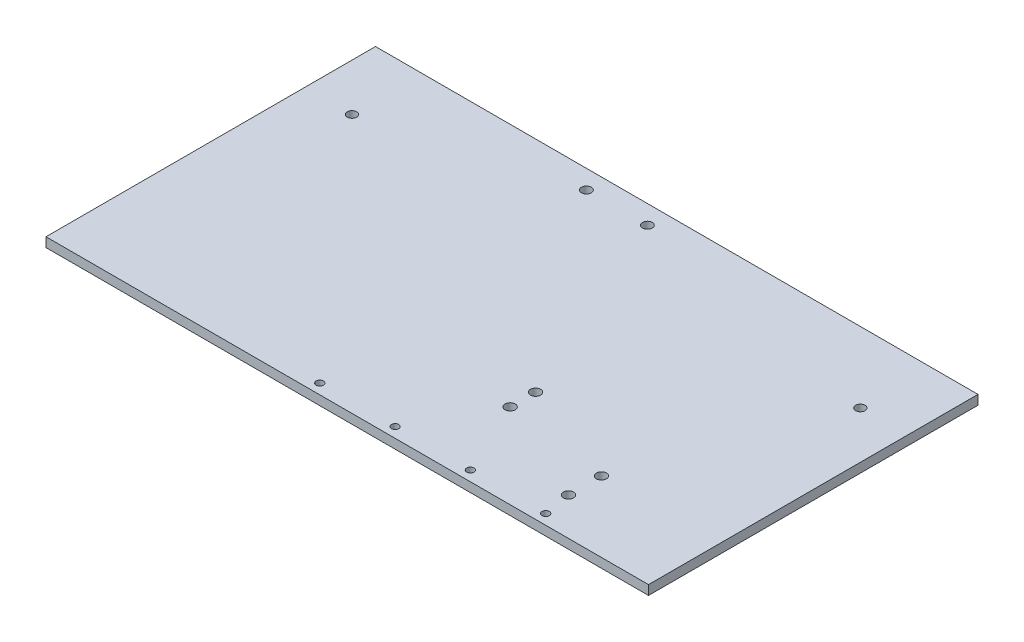
ISO-10303-21;
HEADER;
FILE_DESCRIPTION(('STEP AP214'),'2;1');
FILE_NAME('part.step','',(''),(''),'','','');
FILE_SCHEMA(('AUTOMOTIVE_DESIGN { 1 0 10303 214 1 1 1 1 }'));
ENDSEC;
DATA;
#1=APPLICATION_CONTEXT('core data for automotive mechanical design processes');
#2=APPLICATION_PROTOCOL_DEFINITION('international standard','automotive_design',2000,#1);
#3=PRODUCT_CONTEXT('',#1,'mechanical');
#4=PRODUCT('Part','Part','',(#3));
#5=PRODUCT_RELATED_PRODUCT_CATEGORY('part','',(#4));
#6=PRODUCT_DEFINITION_FORMATION('','',#4);
#7=PRODUCT_DEFINITION_CONTEXT('part definition',#1,'design');
#8=PRODUCT_DEFINITION('design','',#6,#7);
#9=PRODUCT_DEFINITION_SHAPE('','',#8);
#10=(LENGTH_UNIT() NAMED_UNIT(*) SI_UNIT(.MILLI.,.METRE.));
#11=(NAMED_UNIT(*) PLANE_ANGLE_UNIT() SI_UNIT($,.RADIAN.));
#12=(NAMED_UNIT(*) SI_UNIT($,.STERADIAN.) SOLID_ANGLE_UNIT());
#13=UNCERTAINTY_MEASURE_WITH_UNIT(LENGTH_MEASURE(1.E-05),#10,'distance_accuracy_value','');
#14=(GEOMETRIC_REPRESENTATION_CONTEXT(3) GLOBAL_UNCERTAINTY_ASSIGNED_CONTEXT((#13)) GLOBAL_UNIT_ASSIGNED_CONTEXT((#10,
#11,#12)) REPRESENTATION_CONTEXT('',''));
#15=CARTESIAN_POINT('',(0.,0.,0.));
#16=DIRECTION('',(0.,0.,1.));
#17=DIRECTION('',(1.,0.,0.));
#18=AXIS2_PLACEMENT_3D('',#15,#16,#17);
#19=CARTESIAN_POINT('',(-203.2,6.35000000000008,111.125));
#20=DIRECTION('',(1.,0.,0.));
#21=DIRECTION('',(0.,0.,-1.));
#22=AXIS2_PLACEMENT_3D('',#19,#20,#21);
#23=PLANE('',#22);
#24=DIRECTION('',(0.,0.,1.));
#25=VECTOR('',#24,1.);
#26=CARTESIAN_POINT('',(-203.2,2.22044604925031E-13,111.125));
#27=LINE('',#26,#25);
#28=CARTESIAN_POINT('',(-203.2,0.,-111.125));
#29=VERTEX_POINT('',#28);
#30=CARTESIAN_POINT('',(-203.2,2.22044604925031E-13,111.125));
#31=VERTEX_POINT('',#30);
#32=EDGE_CURVE('E105',#29,#31,#27,.T.);
#33=ORIENTED_EDGE('',*,*,#32,.T.);
#34=DIRECTION('',(0.,-1.,0.));
#35=VECTOR('',#34,1.);
#36=CARTESIAN_POINT('',(-203.2,6.35000000000008,111.125));
#37=LINE('',#36,#35);
#38=CARTESIAN_POINT('',(-203.2,6.35000000000008,111.125));
#39=VERTEX_POINT('',#38);
#40=EDGE_CURVE('E11',#39,#31,#37,.T.);
#41=ORIENTED_EDGE('',*,*,#40,.F.);
#42=DIRECTION('',(0.,0.,1.));
#43=VECTOR('',#42,1.);
#44=CARTESIAN_POINT('',(-203.2,6.35000000000008,111.125));
#45=LINE('',#44,#43);
#46=CARTESIAN_POINT('',(-203.2,6.35000000000019,-111.125));
#47=VERTEX_POINT('',#46);
#48=EDGE_CURVE('E93',#47,#39,#45,.T.);
#49=ORIENTED_EDGE('',*,*,#48,.F.);
#50=DIRECTION('',(0.,-1.,0.));
#51=VECTOR('',#50,1.);
#52=CARTESIAN_POINT('',(-203.2,6.35000000000019,-111.125));
#53=LINE('',#52,#51);
#54=EDGE_CURVE('E101',#47,#29,#53,.T.);
#55=ORIENTED_EDGE('',*,*,#54,.T.);
#56=EDGE_LOOP('',(#33,#41,#49,#55));
#57=FACE_BOUND('',#56,.T.);
#58=ADVANCED_FACE('F42',(#57),#23,.F.);
#59=CARTESIAN_POINT('',(203.2,6.34999999999997,111.125));
#60=DIRECTION('',(0.,0.,-1.));
#61=DIRECTION('',(-1.,0.,0.));
#62=AXIS2_PLACEMENT_3D('',#59,#60,#61);
#63=PLANE('',#62);
#64=DIRECTION('',(1.,0.,0.));
#65=VECTOR('',#64,1.);
#66=CARTESIAN_POINT('',(203.2,1.11022302462516E-13,111.125));
#67=LINE('',#66,#65);
#68=CARTESIAN_POINT('',(203.2,1.11022302462516E-13,111.125));
#69=VERTEX_POINT('',#68);
#70=EDGE_CURVE('E97',#31,#69,#67,.T.);
#71=ORIENTED_EDGE('',*,*,#70,.T.);
#72=DIRECTION('',(0.,-1.,0.));
#73=VECTOR('',#72,1.);
#74=CARTESIAN_POINT('',(203.2,6.34999999999997,111.125));
#75=LINE('',#74,#73);
#76=CARTESIAN_POINT('',(203.2,6.34999999999997,111.125));
#77=VERTEX_POINT('',#76);
#78=EDGE_CURVE('E50',#77,#69,#75,.T.);
#79=ORIENTED_EDGE('',*,*,#78,.F.);
#80=DIRECTION('',(1.,0.,0.));
#81=VECTOR('',#80,1.);
#82=CARTESIAN_POINT('',(203.2,6.34999999999997,111.125));
#83=LINE('',#82,#81);
#84=EDGE_CURVE('E88',#39,#77,#83,.T.);
#85=ORIENTED_EDGE('',*,*,#84,.F.);
#86=ORIENTED_EDGE('',*,*,#40,.T.);
#87=EDGE_LOOP('',(#71,#79,#85,#86));
#88=FACE_BOUND('',#87,.T.);
#89=ADVANCED_FACE('F96',(#88),#63,.F.);
#90=CARTESIAN_POINT('',(203.2,6.34999999999997,111.125));
#91=DIRECTION('',(-1.,0.,0.));
#92=DIRECTION('',(0.,0.,1.));
#93=AXIS2_PLACEMENT_3D('',#90,#91,#92);
#94=PLANE('',#93);
#95=DIRECTION('',(0.,0.,-1.));
#96=VECTOR('',#95,1.);
#97=CARTESIAN_POINT('',(203.2,1.11022302462516E-13,111.125));
#98=LINE('',#97,#96);
#99=CARTESIAN_POINT('',(203.2,0.,-111.125));
#100=VERTEX_POINT('',#99);
#101=EDGE_CURVE('E75',#69,#100,#98,.T.);
#102=ORIENTED_EDGE('',*,*,#101,.T.);
#103=DIRECTION('',(0.,-1.,0.));
#104=VECTOR('',#103,1.);
#105=CARTESIAN_POINT('',(203.2,6.34999999999997,-111.125));
#106=LINE('',#105,#104);
#107=CARTESIAN_POINT('',(203.2,6.34999999999997,-111.125));
#108=VERTEX_POINT('',#107);
#109=EDGE_CURVE('E98',#108,#100,#106,.T.);
#110=ORIENTED_EDGE('',*,*,#109,.F.);
#111=DIRECTION('',(0.,0.,-1.));
#112=VECTOR('',#111,1.);
#113=CARTESIAN_POINT('',(203.2,6.34999999999997,111.125));
#114=LINE('',#113,#112);
#115=EDGE_CURVE('E91',#77,#108,#114,.T.);
#116=ORIENTED_EDGE('',*,*,#115,.F.);
#117=ORIENTED_EDGE('',*,*,#78,.T.);
#118=EDGE_LOOP('',(#102,#110,#116,#117));
#119=FACE_BOUND('',#118,.T.);
#120=ADVANCED_FACE('F99',(#119),#94,.F.);
#121=CARTESIAN_POINT('',(203.2,6.34999999999997,-111.125));
#122=DIRECTION('',(0.,0.,1.));
#123=DIRECTION('',(1.,0.,0.));
#124=AXIS2_PLACEMENT_3D('',#121,#122,#123);
#125=PLANE('',#124);
#126=DIRECTION('',(-1.,0.,0.));
#127=VECTOR('',#126,1.);
#128=CARTESIAN_POINT('',(203.2,0.,-111.125));
#129=LINE('',#128,#127);
#130=EDGE_CURVE('E81',#100,#29,#129,.T.);
#131=ORIENTED_EDGE('',*,*,#130,.T.);
#132=ORIENTED_EDGE('',*,*,#54,.F.);
#133=DIRECTION('',(-1.,0.,0.));
#134=VECTOR('',#133,1.);
#135=CARTESIAN_POINT('',(203.2,6.34999999999997,-111.125));
#136=LINE('',#135,#134);
#137=EDGE_CURVE('E58',#108,#47,#136,.T.);
#138=ORIENTED_EDGE('',*,*,#137,.F.);
#139=ORIENTED_EDGE('',*,*,#109,.T.);
#140=EDGE_LOOP('',(#131,#132,#138,#139));
#141=FACE_BOUND('',#140,.T.);
#142=ADVANCED_FACE('F113',(#141),#125,.F.);
#143=CARTESIAN_POINT('',(0.,6.34999999999986,0.));
#144=DIRECTION('',(0.,1.,0.));
#145=DIRECTION('',(0.,0.,1.));
#146=AXIS2_PLACEMENT_3D('',#143,#144,#145);
#147=PLANE('',#146);
#148=CARTESIAN_POINT('',(52.7049999999999,6.34999999999997,36.83));
#149=DIRECTION('',(0.,1.,0.));
#150=DIRECTION('',(0.,0.,1.));
#151=AXIS2_PLACEMENT_3D('',#148,#149,#150);
#152=CIRCLE('',#151,3.429);
#153=CARTESIAN_POINT('',(52.7049999999999,6.34999999999997,40.259));
#154=VERTEX_POINT('',#153);
#155=EDGE_CURVE('E185',#154,#154,#152,.F.);
#156=ORIENTED_EDGE('',*,*,#155,.T.);
#157=EDGE_LOOP('',(#156));
#158=FACE_BOUND('',#157,.T.);
#159=CARTESIAN_POINT('',(52.7049999999999,6.34999999999997,53.975));
#160=DIRECTION('',(0.,1.,0.));
#161=DIRECTION('',(0.,0.,1.));
#162=AXIS2_PLACEMENT_3D('',#159,#160,#161);
#163=CIRCLE('',#162,3.429);
#164=CARTESIAN_POINT('',(52.7049999999999,6.34999999999997,57.404));
#165=VERTEX_POINT('',#164);
#166=EDGE_CURVE('E179',#165,#165,#163,.F.);
#167=ORIENTED_EDGE('',*,*,#166,.T.);
#168=EDGE_LOOP('',(#167));
#169=FACE_BOUND('',#168,.T.);
#170=CARTESIAN_POINT('',(123.825,6.34999999999997,63.5000000000001));
#171=DIRECTION('',(0.,1.,0.));
#172=DIRECTION('',(0.,0.,1.));
#173=AXIS2_PLACEMENT_3D('',#170,#171,#172);
#174=CIRCLE('',#173,3.429);
#175=CARTESIAN_POINT('',(123.825,6.34999999999997,66.9290000000001));
#176=VERTEX_POINT('',#175);
#177=EDGE_CURVE('E173',#176,#176,#174,.F.);
#178=ORIENTED_EDGE('',*,*,#177,.T.);
#179=EDGE_LOOP('',(#178));
#180=FACE_BOUND('',#179,.T.);
#181=CARTESIAN_POINT('',(123.825,6.34999999999997,85.725));
#182=DIRECTION('',(0.,1.,0.));
#183=DIRECTION('',(0.,0.,1.));
#184=AXIS2_PLACEMENT_3D('',#181,#182,#183);
#185=CIRCLE('',#184,3.429);
#186=CARTESIAN_POINT('',(123.825,6.34999999999997,89.154));
#187=VERTEX_POINT('',#186);
#188=EDGE_CURVE('E167',#187,#187,#185,.F.);
#189=ORIENTED_EDGE('',*,*,#188,.T.);
#190=EDGE_LOOP('',(#189));
#191=FACE_BOUND('',#190,.T.);
#192=CARTESIAN_POINT('',(127.,6.35000000000008,104.267));
#193=DIRECTION('',(0.,-1.,0.));
#194=DIRECTION('',(0.,0.,-1.));
#195=AXIS2_PLACEMENT_3D('',#192,#193,#194);
#196=CIRCLE('',#195,2.4638);
#197=CARTESIAN_POINT('',(127.,6.35000000000008,101.8032));
#198=VERTEX_POINT('',#197);
#199=EDGE_CURVE('E129',#198,#198,#196,.T.);
#200=ORIENTED_EDGE('',*,*,#199,.T.);
#201=EDGE_LOOP('',(#200));
#202=FACE_BOUND('',#201,.T.);
#203=CARTESIAN_POINT('',(76.1999999999999,6.34999999999997,104.267));
#204=DIRECTION('',(0.,-1.,0.));
#205=DIRECTION('',(0.,0.,-1.));
#206=AXIS2_PLACEMENT_3D('',#203,#204,#205);
#207=CIRCLE('',#206,2.4638);
#208=CARTESIAN_POINT('',(76.1999999999999,6.34999999999997,101.8032));
#209=VERTEX_POINT('',#208);
#210=EDGE_CURVE('E159',#209,#209,#207,.T.);
#211=ORIENTED_EDGE('',*,*,#210,.T.);
#212=EDGE_LOOP('',(#211));
#213=FACE_BOUND('',#212,.T.);
#214=CARTESIAN_POINT('',(25.3999999999999,6.35000000000008,104.267));
#215=DIRECTION('',(0.,-1.,0.));
#216=DIRECTION('',(0.,0.,-1.));
#217=AXIS2_PLACEMENT_3D('',#214,#215,#216);
#218=CIRCLE('',#217,2.4638);
#219=CARTESIAN_POINT('',(25.3999999999999,6.35000000000008,101.8032));
#220=VERTEX_POINT('',#219);
#221=EDGE_CURVE('E153',#220,#220,#218,.T.);
#222=ORIENTED_EDGE('',*,*,#221,.T.);
#223=EDGE_LOOP('',(#222));
#224=FACE_BOUND('',#223,.T.);
#225=CARTESIAN_POINT('',(-25.4000000000001,6.34999999999997,104.267));
#226=DIRECTION('',(0.,-1.,0.));
#227=DIRECTION('',(0.,0.,-1.));
#228=AXIS2_PLACEMENT_3D('',#225,#226,#227);
#229=CIRCLE('',#228,2.4638);
#230=CARTESIAN_POINT('',(-25.4000000000001,6.34999999999997,101.8032));
#231=VERTEX_POINT('',#230);
#232=EDGE_CURVE('E146',#231,#231,#229,.T.);
#233=ORIENTED_EDGE('',*,*,#232,.T.);
#234=EDGE_LOOP('',(#233));
#235=FACE_BOUND('',#234,.T.);
#236=CARTESIAN_POINT('',(171.45,6.34999999999997,-63.5000000000001));
#237=DIRECTION('',(0.,1.,0.));
#238=DIRECTION('',(0.,0.,1.));
#239=AXIS2_PLACEMENT_3D('',#236,#237,#238);
#240=CIRCLE('',#239,3.175);
#241=CARTESIAN_POINT('',(171.45,6.34999999999997,-60.3250000000001));
#242=VERTEX_POINT('',#241);
#243=EDGE_CURVE('E125',#242,#242,#240,.T.);
#244=ORIENTED_EDGE('',*,*,#243,.F.);
#245=EDGE_LOOP('',(#244));
#246=FACE_BOUND('',#245,.T.);
#247=CARTESIAN_POINT('',(-171.45,6.35000000000008,-63.5));
#248=DIRECTION('',(0.,1.,0.));
#249=DIRECTION('',(0.,0.,1.));
#250=AXIS2_PLACEMENT_3D('',#247,#248,#249);
#251=CIRCLE('',#250,3.175);
#252=CARTESIAN_POINT('',(-171.45,6.35000000000008,-60.325));
#253=VERTEX_POINT('',#252);
#254=EDGE_CURVE('E132',#253,#253,#251,.T.);
#255=ORIENTED_EDGE('',*,*,#254,.F.);
#256=EDGE_LOOP('',(#255));
#257=FACE_BOUND('',#256,.T.);
#258=CARTESIAN_POINT('',(-7.11200000000008,6.35000000000008,-98.4250000000001));
#259=DIRECTION('',(0.,1.,0.));
#260=DIRECTION('',(0.,0.,1.));
#261=AXIS2_PLACEMENT_3D('',#258,#259,#260);
#262=CIRCLE('',#261,3.302);
#263=CARTESIAN_POINT('',(-7.11200000000008,6.35000000000008,-95.1230000000001));
#264=VERTEX_POINT('',#263);
#265=EDGE_CURVE('E138',#264,#264,#262,.T.);
#266=ORIENTED_EDGE('',*,*,#265,.F.);
#267=EDGE_LOOP('',(#266));
#268=FACE_BOUND('',#267,.T.);
#269=CARTESIAN_POINT('',(-48.2600000000001,6.35000000000008,-98.425));
#270=DIRECTION('',(0.,1.,0.));
#271=DIRECTION('',(0.,0.,1.));
#272=AXIS2_PLACEMENT_3D('',#269,#270,#271);
#273=CIRCLE('',#272,3.302);
#274=CARTESIAN_POINT('',(-48.2600000000001,6.35000000000008,-95.123));
#275=VERTEX_POINT('',#274);
#276=EDGE_CURVE('E119',#275,#275,#273,.T.);
#277=ORIENTED_EDGE('',*,*,#276,.F.);
#278=EDGE_LOOP('',(#277));
#279=FACE_BOUND('',#278,.T.);
#280=ORIENTED_EDGE('',*,*,#48,.T.);
#281=ORIENTED_EDGE('',*,*,#84,.T.);
#282=ORIENTED_EDGE('',*,*,#115,.T.);
#283=ORIENTED_EDGE('',*,*,#137,.T.);
#284=EDGE_LOOP('',(#280,#281,#282,#283));
#285=FACE_BOUND('',#284,.T.);
#286=ADVANCED_FACE('F89',(#158,#169,#180,#191,#202,#213,#224,#235,#246,#257,#268,#279,#285),
#147,.T.);
#287=CARTESIAN_POINT('',(0.,0.,0.));
#288=DIRECTION('',(0.,1.,0.));
#289=DIRECTION('',(0.,0.,1.));
#290=AXIS2_PLACEMENT_3D('',#287,#288,#289);
#291=PLANE('',#290);
#292=CARTESIAN_POINT('',(52.705,0.,36.8300000000001));
#293=DIRECTION('',(0.,-1.,0.));
#294=DIRECTION('',(0.,0.,-1.));
#295=AXIS2_PLACEMENT_3D('',#292,#293,#294);
#296=CIRCLE('',#295,3.429);
#297=CARTESIAN_POINT('',(52.705,0.,33.4010000000001));
#298=VERTEX_POINT('',#297);
#299=EDGE_CURVE('E147',#298,#298,#296,.T.);
#300=ORIENTED_EDGE('',*,*,#299,.F.);
#301=EDGE_LOOP('',(#300));
#302=FACE_BOUND('',#301,.T.);
#303=CARTESIAN_POINT('',(52.7049999999999,0.,53.9750000000001));
#304=DIRECTION('',(0.,-1.,0.));
#305=DIRECTION('',(0.,0.,-1.));
#306=AXIS2_PLACEMENT_3D('',#303,#304,#305);
#307=CIRCLE('',#306,3.429);
#308=CARTESIAN_POINT('',(52.7049999999999,0.,50.546));
#309=VERTEX_POINT('',#308);
#310=EDGE_CURVE('E182',#309,#309,#307,.T.);
#311=ORIENTED_EDGE('',*,*,#310,.F.);
#312=EDGE_LOOP('',(#311));
#313=FACE_BOUND('',#312,.T.);
#314=CARTESIAN_POINT('',(123.825,0.,63.5000000000001));
#315=DIRECTION('',(0.,-1.,0.));
#316=DIRECTION('',(0.,0.,-1.));
#317=AXIS2_PLACEMENT_3D('',#314,#315,#316);
#318=CIRCLE('',#317,3.429);
#319=CARTESIAN_POINT('',(123.825,0.,60.0710000000001));
#320=VERTEX_POINT('',#319);
#321=EDGE_CURVE('E176',#320,#320,#318,.T.);
#322=ORIENTED_EDGE('',*,*,#321,.F.);
#323=EDGE_LOOP('',(#322));
#324=FACE_BOUND('',#323,.T.);
#325=CARTESIAN_POINT('',(123.825,2.22044604925031E-13,85.7250000000001));
#326=DIRECTION('',(0.,-1.,0.));
#327=DIRECTION('',(0.,0.,-1.));
#328=AXIS2_PLACEMENT_3D('',#325,#326,#327);
#329=CIRCLE('',#328,3.429);
#330=CARTESIAN_POINT('',(123.825,2.22044604925031E-13,82.2960000000001));
#331=VERTEX_POINT('',#330);
#332=EDGE_CURVE('E170',#331,#331,#329,.T.);
#333=ORIENTED_EDGE('',*,*,#332,.F.);
#334=EDGE_LOOP('',(#333));
#335=FACE_BOUND('',#334,.T.);
#336=CARTESIAN_POINT('',(127.,-2.22044604925031E-13,104.267));
#337=DIRECTION('',(0.,-1.,0.));
#338=DIRECTION('',(0.,0.,-1.));
#339=AXIS2_PLACEMENT_3D('',#336,#337,#338);
#340=CIRCLE('',#339,2.4638);
#341=CARTESIAN_POINT('',(127.,-2.22044604925031E-13,101.8032));
#342=VERTEX_POINT('',#341);
#343=EDGE_CURVE('E162',#342,#342,#340,.T.);
#344=ORIENTED_EDGE('',*,*,#343,.F.);
#345=EDGE_LOOP('',(#344));
#346=FACE_BOUND('',#345,.T.);
#347=CARTESIAN_POINT('',(76.1999999999999,-2.22044604925031E-13,104.267));
#348=DIRECTION('',(0.,-1.,0.));
#349=DIRECTION('',(0.,0.,-1.));
#350=AXIS2_PLACEMENT_3D('',#347,#348,#349);
#351=CIRCLE('',#350,2.4638);
#352=CARTESIAN_POINT('',(76.1999999999999,-2.22044604925031E-13,101.8032));
#353=VERTEX_POINT('',#352);
#354=EDGE_CURVE('E156',#353,#353,#351,.T.);
#355=ORIENTED_EDGE('',*,*,#354,.F.);
#356=EDGE_LOOP('',(#355));
#357=FACE_BOUND('',#356,.T.);
#358=CARTESIAN_POINT('',(25.4,1.11022302462516E-13,104.267));
#359=DIRECTION('',(0.,-1.,0.));
#360=DIRECTION('',(0.,0.,-1.));
#361=AXIS2_PLACEMENT_3D('',#358,#359,#360);
#362=CIRCLE('',#361,2.4638);
#363=CARTESIAN_POINT('',(25.4,1.11022302462516E-13,101.8032));
#364=VERTEX_POINT('',#363);
#365=EDGE_CURVE('E150',#364,#364,#362,.T.);
#366=ORIENTED_EDGE('',*,*,#365,.F.);
#367=EDGE_LOOP('',(#366));
#368=FACE_BOUND('',#367,.T.);
#369=CARTESIAN_POINT('',(-25.4000000000001,2.22044604925031E-13,104.267));
#370=DIRECTION('',(0.,-1.,0.));
#371=DIRECTION('',(0.,0.,-1.));
#372=AXIS2_PLACEMENT_3D('',#369,#370,#371);
#373=CIRCLE('',#372,2.4638);
#374=CARTESIAN_POINT('',(-25.4000000000001,2.22044604925031E-13,101.8032));
#375=VERTEX_POINT('',#374);
#376=EDGE_CURVE('E143',#375,#375,#373,.T.);
#377=ORIENTED_EDGE('',*,*,#376,.F.);
#378=EDGE_LOOP('',(#377));
#379=FACE_BOUND('',#378,.T.);
#380=CARTESIAN_POINT('',(171.45,0.,-63.5000000000001));
#381=DIRECTION('',(0.,1.,0.));
#382=DIRECTION('',(0.,0.,1.));
#383=AXIS2_PLACEMENT_3D('',#380,#381,#382);
#384=CIRCLE('',#383,3.175);
#385=CARTESIAN_POINT('',(171.45,0.,-60.3250000000001));
#386=VERTEX_POINT('',#385);
#387=EDGE_CURVE('E128',#386,#386,#384,.T.);
#388=ORIENTED_EDGE('',*,*,#387,.T.);
#389=EDGE_LOOP('',(#388));
#390=FACE_BOUND('',#389,.T.);
#391=CARTESIAN_POINT('',(-171.45,2.22044604925031E-13,-63.5000000000001));
#392=DIRECTION('',(0.,1.,0.));
#393=DIRECTION('',(0.,0.,1.));
#394=AXIS2_PLACEMENT_3D('',#391,#392,#393);
#395=CIRCLE('',#394,3.175);
#396=CARTESIAN_POINT('',(-171.45,2.22044604925031E-13,-60.3250000000001));
#397=VERTEX_POINT('',#396);
#398=EDGE_CURVE('E135',#397,#397,#395,.T.);
#399=ORIENTED_EDGE('',*,*,#398,.T.);
#400=EDGE_LOOP('',(#399));
#401=FACE_BOUND('',#400,.T.);
#402=CARTESIAN_POINT('',(-7.11200000000008,1.11022302462516E-13,-98.4250000000001));
#403=DIRECTION('',(0.,1.,0.));
#404=DIRECTION('',(0.,0.,1.));
#405=AXIS2_PLACEMENT_3D('',#402,#403,#404);
#406=CIRCLE('',#405,3.302);
#407=CARTESIAN_POINT('',(-7.11200000000008,1.11022302462516E-13,-95.1230000000001));
#408=VERTEX_POINT('',#407);
#409=EDGE_CURVE('E122',#408,#408,#406,.T.);
#410=ORIENTED_EDGE('',*,*,#409,.T.);
#411=EDGE_LOOP('',(#410));
#412=FACE_BOUND('',#411,.T.);
#413=CARTESIAN_POINT('',(-48.2600000000001,1.11022302462516E-13,-98.425));
#414=DIRECTION('',(0.,1.,0.));
#415=DIRECTION('',(0.,0.,1.));
#416=AXIS2_PLACEMENT_3D('',#413,#414,#415);
#417=CIRCLE('',#416,3.302);
#418=CARTESIAN_POINT('',(-48.2600000000001,1.11022302462516E-13,-95.123));
#419=VERTEX_POINT('',#418);
#420=EDGE_CURVE('E108',#419,#419,#417,.T.);
#421=ORIENTED_EDGE('',*,*,#420,.T.);
#422=EDGE_LOOP('',(#421));
#423=FACE_BOUND('',#422,.T.);
#424=ORIENTED_EDGE('',*,*,#32,.F.);
#425=ORIENTED_EDGE('',*,*,#130,.F.);
#426=ORIENTED_EDGE('',*,*,#101,.F.);
#427=ORIENTED_EDGE('',*,*,#70,.F.);
#428=EDGE_LOOP('',(#424,#425,#426,#427));
#429=FACE_BOUND('',#428,.T.);
#430=ADVANCED_FACE('F116',(#302,#313,#324,#335,#346,#357,#368,#379,#390,#401,#412,#423,#429),
#291,.F.);
#431=CARTESIAN_POINT('',(-48.2600000000001,1.11022302462516E-13,-98.425));
#432=DIRECTION('',(0.,1.,0.));
#433=DIRECTION('',(0.,0.,1.));
#434=AXIS2_PLACEMENT_3D('',#431,#432,#433);
#435=CYLINDRICAL_SURFACE('',#434,3.302);
#436=ORIENTED_EDGE('',*,*,#420,.F.);
#437=EDGE_LOOP('',(#436));
#438=FACE_BOUND('',#437,.T.);
#439=ORIENTED_EDGE('',*,*,#276,.T.);
#440=EDGE_LOOP('',(#439));
#441=FACE_BOUND('',#440,.T.);
#442=ADVANCED_FACE('F195',(#438,#441),#435,.F.);
#443=CARTESIAN_POINT('',(-7.11200000000008,1.11022302462516E-13,-98.4250000000001));
#444=DIRECTION('',(0.,1.,0.));
#445=DIRECTION('',(0.,0.,1.));
#446=AXIS2_PLACEMENT_3D('',#443,#444,#445);
#447=CYLINDRICAL_SURFACE('',#446,3.302);
#448=ORIENTED_EDGE('',*,*,#409,.F.);
#449=EDGE_LOOP('',(#448));
#450=FACE_BOUND('',#449,.T.);
#451=ORIENTED_EDGE('',*,*,#265,.T.);
#452=EDGE_LOOP('',(#451));
#453=FACE_BOUND('',#452,.T.);
#454=ADVANCED_FACE('F221',(#450,#453),#447,.F.);
#455=CARTESIAN_POINT('',(-171.45,2.22044604925031E-13,-63.5000000000001));
#456=DIRECTION('',(0.,1.,0.));
#457=DIRECTION('',(0.,0.,1.));
#458=AXIS2_PLACEMENT_3D('',#455,#456,#457);
#459=CYLINDRICAL_SURFACE('',#458,3.175);
#460=ORIENTED_EDGE('',*,*,#398,.F.);
#461=EDGE_LOOP('',(#460));
#462=FACE_BOUND('',#461,.T.);
#463=ORIENTED_EDGE('',*,*,#254,.T.);
#464=EDGE_LOOP('',(#463));
#465=FACE_BOUND('',#464,.T.);
#466=ADVANCED_FACE('F264',(#462,#465),#459,.F.);
#467=CARTESIAN_POINT('',(171.45,0.,-63.5000000000001));
#468=DIRECTION('',(0.,1.,0.));
#469=DIRECTION('',(0.,0.,1.));
#470=AXIS2_PLACEMENT_3D('',#467,#468,#469);
#471=CYLINDRICAL_SURFACE('',#470,3.175);
#472=ORIENTED_EDGE('',*,*,#387,.F.);
#473=EDGE_LOOP('',(#472));
#474=FACE_BOUND('',#473,.T.);
#475=ORIENTED_EDGE('',*,*,#243,.T.);
#476=EDGE_LOOP('',(#475));
#477=FACE_BOUND('',#476,.T.);
#478=ADVANCED_FACE('F272',(#474,#477),#471,.F.);
#479=CARTESIAN_POINT('',(-25.4000000000001,6.34999999999997,104.267));
#480=DIRECTION('',(0.,-1.,0.));
#481=DIRECTION('',(0.,0.,-1.));
#482=AXIS2_PLACEMENT_3D('',#479,#480,#481);
#483=CYLINDRICAL_SURFACE('',#482,2.4638);
#484=ORIENTED_EDGE('',*,*,#232,.F.);
#485=EDGE_LOOP('',(#484));
#486=FACE_BOUND('',#485,.T.);
#487=ORIENTED_EDGE('',*,*,#376,.T.);
#488=EDGE_LOOP('',(#487));
#489=FACE_BOUND('',#488,.T.);
#490=ADVANCED_FACE('F280',(#486,#489),#483,.F.);
#491=CARTESIAN_POINT('',(25.3999999999999,6.35000000000008,104.267));
#492=DIRECTION('',(0.,-1.,0.));
#493=DIRECTION('',(0.,0.,-1.));
#494=AXIS2_PLACEMENT_3D('',#491,#492,#493);
#495=CYLINDRICAL_SURFACE('',#494,2.4638);
#496=ORIENTED_EDGE('',*,*,#221,.F.);
#497=EDGE_LOOP('',(#496));
#498=FACE_BOUND('',#497,.T.);
#499=ORIENTED_EDGE('',*,*,#365,.T.);
#500=EDGE_LOOP('',(#499));
#501=FACE_BOUND('',#500,.T.);
#502=ADVANCED_FACE('F288',(#498,#501),#495,.F.);
#503=CARTESIAN_POINT('',(76.1999999999999,6.34999999999997,104.267));
#504=DIRECTION('',(0.,-1.,0.));
#505=DIRECTION('',(0.,0.,-1.));
#506=AXIS2_PLACEMENT_3D('',#503,#504,#505);
#507=CYLINDRICAL_SURFACE('',#506,2.4638);
#508=ORIENTED_EDGE('',*,*,#210,.F.);
#509=EDGE_LOOP('',(#508));
#510=FACE_BOUND('',#509,.T.);
#511=ORIENTED_EDGE('',*,*,#354,.T.);
#512=EDGE_LOOP('',(#511));
#513=FACE_BOUND('',#512,.T.);
#514=ADVANCED_FACE('F296',(#510,#513),#507,.F.);
#515=CARTESIAN_POINT('',(127.,6.35000000000008,104.267));
#516=DIRECTION('',(0.,-1.,0.));
#517=DIRECTION('',(0.,0.,-1.));
#518=AXIS2_PLACEMENT_3D('',#515,#516,#517);
#519=CYLINDRICAL_SURFACE('',#518,2.4638);
#520=ORIENTED_EDGE('',*,*,#199,.F.);
#521=EDGE_LOOP('',(#520));
#522=FACE_BOUND('',#521,.T.);
#523=ORIENTED_EDGE('',*,*,#343,.T.);
#524=EDGE_LOOP('',(#523));
#525=FACE_BOUND('',#524,.T.);
#526=ADVANCED_FACE('F304',(#522,#525),#519,.F.);
#527=CARTESIAN_POINT('',(123.825,6.35099999999988,85.725));
#528=DIRECTION('',(0.,-1.,0.));
#529=DIRECTION('',(0.,0.,-1.));
#530=AXIS2_PLACEMENT_3D('',#527,#528,#529);
#531=CYLINDRICAL_SURFACE('',#530,3.429);
#532=ORIENTED_EDGE('',*,*,#188,.F.);
#533=EDGE_LOOP('',(#532));
#534=FACE_BOUND('',#533,.T.);
#535=ORIENTED_EDGE('',*,*,#332,.T.);
#536=EDGE_LOOP('',(#535));
#537=FACE_BOUND('',#536,.T.);
#538=ADVANCED_FACE('F312',(#534,#537),#531,.F.);
#539=CARTESIAN_POINT('',(123.825,6.351,63.5000000000001));
#540=DIRECTION('',(0.,-1.,0.));
#541=DIRECTION('',(0.,0.,-1.));
#542=AXIS2_PLACEMENT_3D('',#539,#540,#541);
#543=CYLINDRICAL_SURFACE('',#542,3.429);
#544=ORIENTED_EDGE('',*,*,#177,.F.);
#545=EDGE_LOOP('',(#544));
#546=FACE_BOUND('',#545,.T.);
#547=ORIENTED_EDGE('',*,*,#321,.T.);
#548=EDGE_LOOP('',(#547));
#549=FACE_BOUND('',#548,.T.);
#550=ADVANCED_FACE('F320',(#546,#549),#543,.F.);
#551=CARTESIAN_POINT('',(52.7049999999999,6.35100000000011,53.9750000000001));
#552=DIRECTION('',(0.,-1.,0.));
#553=DIRECTION('',(0.,0.,-1.));
#554=AXIS2_PLACEMENT_3D('',#551,#552,#553);
#555=CYLINDRICAL_SURFACE('',#554,3.429);
#556=ORIENTED_EDGE('',*,*,#166,.F.);
#557=EDGE_LOOP('',(#556));
#558=FACE_BOUND('',#557,.T.);
#559=ORIENTED_EDGE('',*,*,#310,.T.);
#560=EDGE_LOOP('',(#559));
#561=FACE_BOUND('',#560,.T.);
#562=ADVANCED_FACE('F328',(#558,#561),#555,.F.);
#563=CARTESIAN_POINT('',(52.7049999999999,6.35100000000022,36.83));
#564=DIRECTION('',(0.,-1.,0.));
#565=DIRECTION('',(0.,0.,-1.));
#566=AXIS2_PLACEMENT_3D('',#563,#564,#565);
#567=CYLINDRICAL_SURFACE('',#566,3.429);
#568=ORIENTED_EDGE('',*,*,#155,.F.);
#569=EDGE_LOOP('',(#568));
#570=FACE_BOUND('',#569,.T.);
#571=ORIENTED_EDGE('',*,*,#299,.T.);
#572=EDGE_LOOP('',(#571));
#573=FACE_BOUND('',#572,.T.);
#574=ADVANCED_FACE('F191',(#570,#573),#567,.F.);
#575=CLOSED_SHELL('',(#58,#89,#120,#142,#286,#430,#442,#454,#466,#478,#490,#502,#514,#526,#538,
#550,#562,#574));
#576=MANIFOLD_SOLID_BREP('B2',#575);
#577=ADVANCED_BREP_SHAPE_REPRESENTATION('',(#18,#576),#14);
#578=SHAPE_DEFINITION_REPRESENTATION(#9,#577);
ENDSEC;
END-ISO-10303-21;
